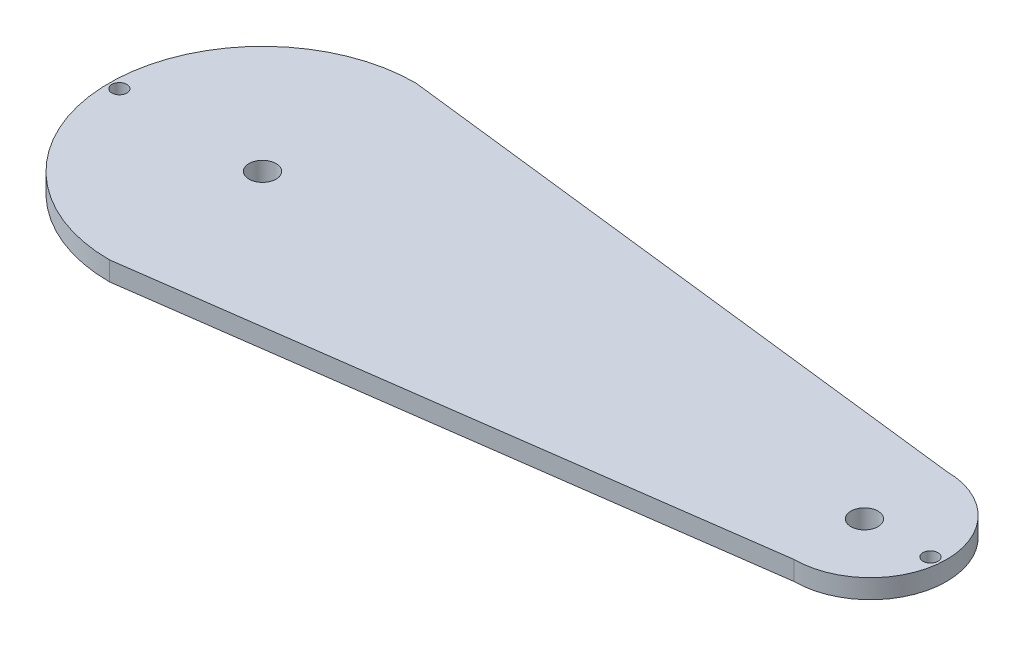
ISO-10303-21;
HEADER;
FILE_DESCRIPTION(('STEP AP214'),'2;1');
FILE_NAME('part.step','',(''),(''),'','','');
FILE_SCHEMA(('AUTOMOTIVE_DESIGN { 1 0 10303 214 1 1 1 1 }'));
ENDSEC;
DATA;
#1=APPLICATION_CONTEXT('core data for automotive mechanical design processes');
#2=APPLICATION_PROTOCOL_DEFINITION('international standard','automotive_design',2000,#1);
#3=PRODUCT_CONTEXT('',#1,'mechanical');
#4=PRODUCT('Part','Part','',(#3));
#5=PRODUCT_RELATED_PRODUCT_CATEGORY('part','',(#4));
#6=PRODUCT_DEFINITION_FORMATION('','',#4);
#7=PRODUCT_DEFINITION_CONTEXT('part definition',#1,'design');
#8=PRODUCT_DEFINITION('design','',#6,#7);
#9=PRODUCT_DEFINITION_SHAPE('','',#8);
#10=(LENGTH_UNIT() NAMED_UNIT(*) SI_UNIT(.MILLI.,.METRE.));
#11=(NAMED_UNIT(*) PLANE_ANGLE_UNIT() SI_UNIT($,.RADIAN.));
#12=(NAMED_UNIT(*) SI_UNIT($,.STERADIAN.) SOLID_ANGLE_UNIT());
#13=UNCERTAINTY_MEASURE_WITH_UNIT(LENGTH_MEASURE(1.E-05),#10,'distance_accuracy_value','');
#14=(GEOMETRIC_REPRESENTATION_CONTEXT(3) GLOBAL_UNCERTAINTY_ASSIGNED_CONTEXT((#13)) GLOBAL_UNIT_ASSIGNED_CONTEXT((#10,
#11,#12)) REPRESENTATION_CONTEXT('',''));
#15=CARTESIAN_POINT('',(0.,0.,0.));
#16=DIRECTION('',(0.,0.,1.));
#17=DIRECTION('',(1.,0.,0.));
#18=AXIS2_PLACEMENT_3D('',#15,#16,#17);
#19=CARTESIAN_POINT('',(200.000108,25.4,-1.96579943785256));
#20=DIRECTION('',(0.,-1.,0.));
#21=DIRECTION('',(0.,0.,-1.));
#22=AXIS2_PLACEMENT_3D('',#19,#20,#21);
#23=CYLINDRICAL_SURFACE('',#22,25.3369705323219);
#24=CARTESIAN_POINT('',(200.000108,19.05,-1.96579943785256));
#25=DIRECTION('',(0.,1.,0.));
#26=DIRECTION('',(0.,0.,1.));
#27=AXIS2_PLACEMENT_3D('',#24,#25,#26);
#28=CIRCLE('',#27,25.3369705323219);
#29=CARTESIAN_POINT('',(200.000108,19.05,23.3711710944694));
#30=VERTEX_POINT('',#29);
#31=CARTESIAN_POINT('',(200.000108,19.05,-27.3027699701745));
#32=VERTEX_POINT('',#31);
#33=EDGE_CURVE('E62',#30,#32,#28,.T.);
#34=ORIENTED_EDGE('',*,*,#33,.T.);
#35=DIRECTION('',(0.,-1.,0.));
#36=VECTOR('',#35,1.);
#37=CARTESIAN_POINT('',(200.000108,25.4,-27.3027699701745));
#38=LINE('',#37,#36);
#39=CARTESIAN_POINT('',(200.000108,25.4,-27.3027699701745));
#40=VERTEX_POINT('',#39);
#41=EDGE_CURVE('E11',#40,#32,#38,.T.);
#42=ORIENTED_EDGE('',*,*,#41,.F.);
#43=CARTESIAN_POINT('',(200.000108,25.4,-1.96579943785256));
#44=DIRECTION('',(0.,1.,0.));
#45=DIRECTION('',(0.,0.,1.));
#46=AXIS2_PLACEMENT_3D('',#43,#44,#45);
#47=CIRCLE('',#46,25.3369705323219);
#48=CARTESIAN_POINT('',(200.000108,25.4,23.3711710944694));
#49=VERTEX_POINT('',#48);
#50=EDGE_CURVE('E149',#49,#40,#47,.T.);
#51=ORIENTED_EDGE('',*,*,#50,.F.);
#52=DIRECTION('',(0.,-1.,0.));
#53=VECTOR('',#52,1.);
#54=CARTESIAN_POINT('',(200.000108,25.4,23.3711710944694));
#55=LINE('',#54,#53);
#56=EDGE_CURVE('E69',#49,#30,#55,.T.);
#57=ORIENTED_EDGE('',*,*,#56,.T.);
#58=EDGE_LOOP('',(#34,#42,#51,#57));
#59=FACE_BOUND('',#58,.T.);
#60=ADVANCED_FACE('F45',(#59),#23,.T.);
#61=CARTESIAN_POINT('',(0.,25.4,-50.8923632244053));
#62=DIRECTION('',(0.117135936329746,0.,-0.993115890729855));
#63=DIRECTION('',(-0.993115890729855,0.,-0.117135936329746));
#64=AXIS2_PLACEMENT_3D('',#61,#62,#63);
#65=PLANE('',#64);
#66=ORIENTED_EDGE('',*,*,#41,.T.);
#67=DIRECTION('',(-0.993115890729855,0.,-0.117135936329746));
#68=VECTOR('',#67,1.);
#69=CARTESIAN_POINT('',(0.,19.05,-50.8923632244053));
#70=LINE('',#69,#68);
#71=CARTESIAN_POINT('',(0.,19.05,-50.8923632244053));
#72=VERTEX_POINT('',#71);
#73=EDGE_CURVE('E118',#32,#72,#70,.T.);
#74=ORIENTED_EDGE('',*,*,#73,.T.);
#75=DIRECTION('',(0.,-1.,0.));
#76=VECTOR('',#75,1.);
#77=CARTESIAN_POINT('',(0.,25.4,-50.8923632244053));
#78=LINE('',#77,#76);
#79=CARTESIAN_POINT('',(0.,25.4,-50.8923632244053));
#80=VERTEX_POINT('',#79);
#81=EDGE_CURVE('E54',#80,#72,#78,.T.);
#82=ORIENTED_EDGE('',*,*,#81,.F.);
#83=DIRECTION('',(0.993115890729855,0.,0.117135936329746));
#84=VECTOR('',#83,1.);
#85=CARTESIAN_POINT('',(0.,25.4,-50.8923632244053));
#86=LINE('',#85,#84);
#87=EDGE_CURVE('E155',#80,#40,#86,.T.);
#88=ORIENTED_EDGE('',*,*,#87,.T.);
#89=EDGE_LOOP('',(#66,#74,#82,#88));
#90=FACE_BOUND('',#89,.T.);
#91=ADVANCED_FACE('F167',(#90),#65,.T.);
#92=CARTESIAN_POINT('',(0.,25.4,0.));
#93=DIRECTION('',(0.,-1.,0.));
#94=DIRECTION('',(0.,0.,-1.));
#95=AXIS2_PLACEMENT_3D('',#92,#93,#94);
#96=CYLINDRICAL_SURFACE('',#95,50.8923632244053);
#97=ORIENTED_EDGE('',*,*,#81,.T.);
#98=CARTESIAN_POINT('',(0.,19.05,0.));
#99=DIRECTION('',(0.,1.,0.));
#100=DIRECTION('',(0.,0.,-1.));
#101=AXIS2_PLACEMENT_3D('',#98,#99,#100);
#102=CIRCLE('',#101,50.8923632244053);
#103=CARTESIAN_POINT('',(0.,19.05,50.8923632244053));
#104=VERTEX_POINT('',#103);
#105=EDGE_CURVE('E90',#72,#104,#102,.T.);
#106=ORIENTED_EDGE('',*,*,#105,.T.);
#107=DIRECTION('',(0.,-1.,0.));
#108=VECTOR('',#107,1.);
#109=CARTESIAN_POINT('',(0.,25.4,50.8923632244053));
#110=LINE('',#109,#108);
#111=CARTESIAN_POINT('',(0.,25.4,50.8923632244053));
#112=VERTEX_POINT('',#111);
#113=EDGE_CURVE('E99',#112,#104,#110,.T.);
#114=ORIENTED_EDGE('',*,*,#113,.F.);
#115=CARTESIAN_POINT('',(0.,25.4,0.));
#116=DIRECTION('',(0.,-1.,0.));
#117=DIRECTION('',(0.,0.,-1.));
#118=AXIS2_PLACEMENT_3D('',#115,#116,#117);
#119=CIRCLE('',#118,50.8923632244053);
#120=EDGE_CURVE('E159',#112,#80,#119,.T.);
#121=ORIENTED_EDGE('',*,*,#120,.T.);
#122=EDGE_LOOP('',(#97,#106,#114,#121));
#123=FACE_BOUND('',#122,.T.);
#124=ADVANCED_FACE('F97',(#123),#96,.T.);
#125=CARTESIAN_POINT('',(200.000108,25.4,23.3711710944694));
#126=DIRECTION('',(0.136321291177113,0.,0.99066467867377));
#127=DIRECTION('',(0.99066467867377,0.,-0.136321291177113));
#128=AXIS2_PLACEMENT_3D('',#125,#126,#127);
#129=PLANE('',#128);
#130=ORIENTED_EDGE('',*,*,#113,.T.);
#131=DIRECTION('',(0.99066467867377,0.,-0.136321291177113));
#132=VECTOR('',#131,1.);
#133=CARTESIAN_POINT('',(200.000108,19.05,23.3711710944694));
#134=LINE('',#133,#132);
#135=EDGE_CURVE('E86',#104,#30,#134,.T.);
#136=ORIENTED_EDGE('',*,*,#135,.T.);
#137=ORIENTED_EDGE('',*,*,#56,.F.);
#138=DIRECTION('',(-0.99066467867377,0.,0.136321291177113));
#139=VECTOR('',#138,1.);
#140=CARTESIAN_POINT('',(200.000108,25.4,23.3711710944694));
#141=LINE('',#140,#139);
#142=EDGE_CURVE('E105',#49,#112,#141,.T.);
#143=ORIENTED_EDGE('',*,*,#142,.T.);
#144=EDGE_LOOP('',(#130,#136,#137,#143));
#145=FACE_BOUND('',#144,.T.);
#146=ADVANCED_FACE('F103',(#145),#129,.T.);
#147=CARTESIAN_POINT('',(221.926143203889,0.,0.));
#148=DIRECTION('',(0.,1.,0.));
#149=DIRECTION('',(0.,0.,1.));
#150=AXIS2_PLACEMENT_3D('',#147,#148,#149);
#151=CYLINDRICAL_SURFACE('',#150,2.5);
#152=CARTESIAN_POINT('',(221.926143203889,25.4,0.));
#153=DIRECTION('',(0.,1.,0.));
#154=DIRECTION('',(0.,0.,1.));
#155=AXIS2_PLACEMENT_3D('',#152,#153,#154);
#156=CIRCLE('',#155,2.5);
#157=CARTESIAN_POINT('',(221.926143203889,25.4,2.5));
#158=VERTEX_POINT('',#157);
#159=EDGE_CURVE('E144',#158,#158,#156,.T.);
#160=ORIENTED_EDGE('',*,*,#159,.T.);
#161=EDGE_LOOP('',(#160));
#162=FACE_BOUND('',#161,.T.);
#163=CARTESIAN_POINT('',(221.926143203889,19.05,0.));
#164=DIRECTION('',(0.,-1.,0.));
#165=DIRECTION('',(0.,0.,-1.));
#166=AXIS2_PLACEMENT_3D('',#163,#164,#165);
#167=CIRCLE('',#166,2.5);
#168=CARTESIAN_POINT('',(221.926143203889,19.05,-2.5));
#169=VERTEX_POINT('',#168);
#170=EDGE_CURVE('E117',#169,#169,#167,.F.);
#171=ORIENTED_EDGE('',*,*,#170,.F.);
#172=EDGE_LOOP('',(#171));
#173=FACE_BOUND('',#172,.T.);
#174=ADVANCED_FACE('F180',(#162,#173),#151,.F.);
#175=CARTESIAN_POINT('',(-47.5690802204069,0.,0.));
#176=DIRECTION('',(0.,1.,0.));
#177=DIRECTION('',(0.,0.,1.));
#178=AXIS2_PLACEMENT_3D('',#175,#176,#177);
#179=CYLINDRICAL_SURFACE('',#178,2.5);
#180=CARTESIAN_POINT('',(-47.5690802204069,25.4,0.));
#181=DIRECTION('',(0.,1.,0.));
#182=DIRECTION('',(0.,0.,1.));
#183=AXIS2_PLACEMENT_3D('',#180,#181,#182);
#184=CIRCLE('',#183,2.5);
#185=CARTESIAN_POINT('',(-47.5690802204069,25.4,2.5));
#186=VERTEX_POINT('',#185);
#187=EDGE_CURVE('E145',#186,#186,#184,.T.);
#188=ORIENTED_EDGE('',*,*,#187,.T.);
#189=EDGE_LOOP('',(#188));
#190=FACE_BOUND('',#189,.T.);
#191=CARTESIAN_POINT('',(-47.5690802204069,19.05,0.));
#192=DIRECTION('',(0.,-1.,0.));
#193=DIRECTION('',(0.,0.,-1.));
#194=AXIS2_PLACEMENT_3D('',#191,#192,#193);
#195=CIRCLE('',#194,2.5);
#196=CARTESIAN_POINT('',(-47.5690802204069,19.05,-2.5));
#197=VERTEX_POINT('',#196);
#198=EDGE_CURVE('E114',#197,#197,#195,.F.);
#199=ORIENTED_EDGE('',*,*,#198,.F.);
#200=EDGE_LOOP('',(#199));
#201=FACE_BOUND('',#200,.T.);
#202=ADVANCED_FACE('F183',(#190,#201),#179,.F.);
#203=CARTESIAN_POINT('',(200.000108,25.4,-1.96579943785256));
#204=DIRECTION('',(0.,1.,0.));
#205=DIRECTION('',(0.,0.,1.));
#206=AXIS2_PLACEMENT_3D('',#203,#204,#205);
#207=PLANE('',#206);
#208=CARTESIAN_POINT('',(200.000108,25.4,0.));
#209=DIRECTION('',(0.,1.,0.));
#210=DIRECTION('',(0.,0.,1.));
#211=AXIS2_PLACEMENT_3D('',#208,#209,#210);
#212=CIRCLE('',#211,4.49999999999999);
#213=CARTESIAN_POINT('',(200.000108,25.4,4.49999999999999));
#214=VERTEX_POINT('',#213);
#215=EDGE_CURVE('E122',#214,#214,#212,.T.);
#216=ORIENTED_EDGE('',*,*,#215,.F.);
#217=EDGE_LOOP('',(#216));
#218=FACE_BOUND('',#217,.T.);
#219=CARTESIAN_POINT('',(0.,25.4,0.));
#220=DIRECTION('',(0.,1.,0.));
#221=DIRECTION('',(0.,0.,1.));
#222=AXIS2_PLACEMENT_3D('',#219,#220,#221);
#223=CIRCLE('',#222,4.5);
#224=CARTESIAN_POINT('',(0.,25.4,4.5));
#225=VERTEX_POINT('',#224);
#226=EDGE_CURVE('E129',#225,#225,#223,.T.);
#227=ORIENTED_EDGE('',*,*,#226,.F.);
#228=EDGE_LOOP('',(#227));
#229=FACE_BOUND('',#228,.T.);
#230=ORIENTED_EDGE('',*,*,#187,.F.);
#231=EDGE_LOOP('',(#230));
#232=FACE_BOUND('',#231,.T.);
#233=ORIENTED_EDGE('',*,*,#159,.F.);
#234=EDGE_LOOP('',(#233));
#235=FACE_BOUND('',#234,.T.);
#236=ORIENTED_EDGE('',*,*,#50,.T.);
#237=ORIENTED_EDGE('',*,*,#87,.F.);
#238=ORIENTED_EDGE('',*,*,#120,.F.);
#239=ORIENTED_EDGE('',*,*,#142,.F.);
#240=EDGE_LOOP('',(#236,#237,#238,#239));
#241=FACE_BOUND('',#240,.T.);
#242=ADVANCED_FACE('F164',(#218,#229,#232,#235,#241),#207,.T.);
#243=CARTESIAN_POINT('',(0.,19.05,0.));
#244=DIRECTION('',(0.,-1.,0.));
#245=DIRECTION('',(0.,0.,-1.));
#246=AXIS2_PLACEMENT_3D('',#243,#244,#245);
#247=PLANE('',#246);
#248=CARTESIAN_POINT('',(200.000108,19.05,0.));
#249=DIRECTION('',(0.,-1.,0.));
#250=DIRECTION('',(0.,0.,-1.));
#251=AXIS2_PLACEMENT_3D('',#248,#249,#250);
#252=CIRCLE('',#251,4.49999999999999);
#253=CARTESIAN_POINT('',(200.000108,19.05,-4.49999999999999));
#254=VERTEX_POINT('',#253);
#255=EDGE_CURVE('E48',#254,#254,#252,.T.);
#256=ORIENTED_EDGE('',*,*,#255,.F.);
#257=EDGE_LOOP('',(#256));
#258=FACE_BOUND('',#257,.T.);
#259=CARTESIAN_POINT('',(0.,19.05,0.));
#260=DIRECTION('',(0.,-1.,0.));
#261=DIRECTION('',(0.,0.,-1.));
#262=AXIS2_PLACEMENT_3D('',#259,#260,#261);
#263=CIRCLE('',#262,4.5);
#264=CARTESIAN_POINT('',(0.,19.05,-4.5));
#265=VERTEX_POINT('',#264);
#266=EDGE_CURVE('E119',#265,#265,#263,.T.);
#267=ORIENTED_EDGE('',*,*,#266,.F.);
#268=EDGE_LOOP('',(#267));
#269=FACE_BOUND('',#268,.T.);
#270=ORIENTED_EDGE('',*,*,#105,.F.);
#271=ORIENTED_EDGE('',*,*,#73,.F.);
#272=ORIENTED_EDGE('',*,*,#33,.F.);
#273=ORIENTED_EDGE('',*,*,#135,.F.);
#274=EDGE_LOOP('',(#270,#271,#272,#273));
#275=FACE_BOUND('',#274,.T.);
#276=ORIENTED_EDGE('',*,*,#198,.T.);
#277=EDGE_LOOP('',(#276));
#278=FACE_BOUND('',#277,.T.);
#279=ORIENTED_EDGE('',*,*,#170,.T.);
#280=EDGE_LOOP('',(#279));
#281=FACE_BOUND('',#280,.T.);
#282=ADVANCED_FACE('F88',(#258,#269,#275,#278,#281),#247,.T.);
#283=CARTESIAN_POINT('',(0.,6.35,0.));
#284=DIRECTION('',(0.,1.,0.));
#285=DIRECTION('',(0.,0.,1.));
#286=AXIS2_PLACEMENT_3D('',#283,#284,#285);
#287=CYLINDRICAL_SURFACE('',#286,4.5);
#288=ORIENTED_EDGE('',*,*,#266,.T.);
#289=EDGE_LOOP('',(#288));
#290=FACE_BOUND('',#289,.T.);
#291=ORIENTED_EDGE('',*,*,#226,.T.);
#292=EDGE_LOOP('',(#291));
#293=FACE_BOUND('',#292,.T.);
#294=ADVANCED_FACE('F193',(#290,#293),#287,.F.);
#295=CARTESIAN_POINT('',(200.000108,6.35,0.));
#296=DIRECTION('',(0.,1.,0.));
#297=DIRECTION('',(0.,0.,1.));
#298=AXIS2_PLACEMENT_3D('',#295,#296,#297);
#299=CYLINDRICAL_SURFACE('',#298,4.49999999999999);
#300=ORIENTED_EDGE('',*,*,#255,.T.);
#301=EDGE_LOOP('',(#300));
#302=FACE_BOUND('',#301,.T.);
#303=ORIENTED_EDGE('',*,*,#215,.T.);
#304=EDGE_LOOP('',(#303));
#305=FACE_BOUND('',#304,.T.);
#306=ADVANCED_FACE('F197',(#302,#305),#299,.F.);
#307=CLOSED_SHELL('',(#60,#91,#124,#146,#174,#202,#242,#282,#294,#306));
#308=MANIFOLD_SOLID_BREP('B2',#307);
#309=ADVANCED_BREP_SHAPE_REPRESENTATION('',(#18,#308),#14);
#310=SHAPE_DEFINITION_REPRESENTATION(#9,#309);
ENDSEC;
END-ISO-10303-21;
